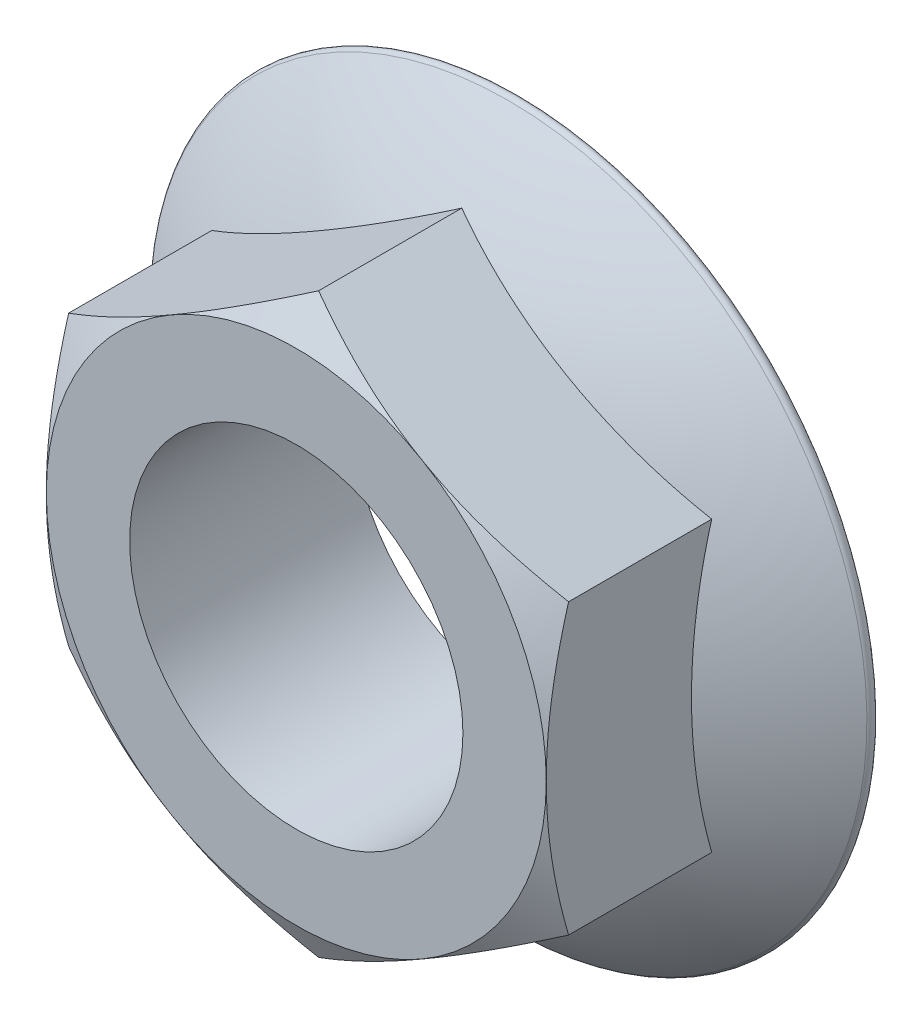
ISO-10303-21;
HEADER;
FILE_DESCRIPTION(('STEP AP214'),'2;1');
FILE_NAME('part.step','',(''),(''),'','','');
FILE_SCHEMA(('AUTOMOTIVE_DESIGN { 1 0 10303 214 1 1 1 1 }'));
ENDSEC;
DATA;
#1=APPLICATION_CONTEXT('core data for automotive mechanical design processes');
#2=APPLICATION_PROTOCOL_DEFINITION('international standard','automotive_design',2000,#1);
#3=PRODUCT_CONTEXT('',#1,'mechanical');
#4=PRODUCT('Part','Part','',(#3));
#5=PRODUCT_RELATED_PRODUCT_CATEGORY('part','',(#4));
#6=PRODUCT_DEFINITION_FORMATION('','',#4);
#7=PRODUCT_DEFINITION_CONTEXT('part definition',#1,'design');
#8=PRODUCT_DEFINITION('design','',#6,#7);
#9=PRODUCT_DEFINITION_SHAPE('','',#8);
#10=(LENGTH_UNIT() NAMED_UNIT(*) SI_UNIT(.MILLI.,.METRE.));
#11=(NAMED_UNIT(*) PLANE_ANGLE_UNIT() SI_UNIT($,.RADIAN.));
#12=(NAMED_UNIT(*) SI_UNIT($,.STERADIAN.) SOLID_ANGLE_UNIT());
#13=UNCERTAINTY_MEASURE_WITH_UNIT(LENGTH_MEASURE(1.E-05),#10,'distance_accuracy_value','');
#14=(GEOMETRIC_REPRESENTATION_CONTEXT(3) GLOBAL_UNCERTAINTY_ASSIGNED_CONTEXT((#13)) GLOBAL_UNIT_ASSIGNED_CONTEXT((#10,
#11,#12)) REPRESENTATION_CONTEXT('',''));
#15=CARTESIAN_POINT('',(0.,0.,0.));
#16=DIRECTION('',(0.,0.,1.));
#17=DIRECTION('',(1.,0.,0.));
#18=AXIS2_PLACEMENT_3D('',#15,#16,#17);
#19=CARTESIAN_POINT('',(22.5,12.9903810567666,20.));
#20=DIRECTION('',(-0.5,-0.866025403784439,0.));
#21=DIRECTION('',(0.866025403784439,-0.5,0.));
#22=AXIS2_PLACEMENT_3D('',#19,#20,#21);
#23=PLANE('',#22);
#24=CARTESIAN_POINT('',(22.5002,12.9902655867127,17.9903143896555));
#25=CARTESIAN_POINT('',(22.0056596846796,13.2757885708881,18.1551492707593));
#26=CARTESIAN_POINT('',(21.5091903987605,13.5624252467579,18.3125041584607));
#27=CARTESIAN_POINT('',(20.5122707379121,14.1379970813091,18.6101747825265));
#28=CARTESIAN_POINT('',(20.0118191109477,14.4269329628534,18.7504849147612));
#29=CARTESIAN_POINT('',(19.0059568955598,15.0076677836753,19.0121827394149));
#30=CARTESIAN_POINT('',(18.5005374245995,15.2994718512879,19.1335252438812));
#31=CARTESIAN_POINT('',(17.4862080086853,15.8850952126129,19.3546738156916));
#32=CARTESIAN_POINT('',(16.9772984166632,16.17891430256,19.4544820284597));
#33=CARTESIAN_POINT('',(15.968996914576,16.7610574462144,19.6283253044473));
#34=CARTESIAN_POINT('',(15.4696797954967,17.0493383193258,19.7029352669185));
#35=CARTESIAN_POINT('',(14.4687576454327,17.6272209921031,19.8280391846674));
#36=CARTESIAN_POINT('',(13.9671525705959,17.916822817087,19.8785326757383));
#37=CARTESIAN_POINT('',(12.9630998176583,18.4965129442762,19.954128715289));
#38=CARTESIAN_POINT('',(12.4606538548355,18.7866002561651,19.9792614354897));
#39=CARTESIAN_POINT('',(11.4552982591454,19.3670425799681,20.0035954599864));
#40=CARTESIAN_POINT('',(10.9523886410861,19.6573975833327,20.0027975655861));
#41=CARTESIAN_POINT('',(10.0121905167879,20.2002212234878,19.9770814657185));
#42=CARTESIAN_POINT('',(9.57483504956042,20.4527285202232,19.9552991118006));
#43=CARTESIAN_POINT('',(8.70116824358618,20.9571402858345,19.892536574804));
#44=CARTESIAN_POINT('',(8.26485688997456,21.2090447632926,19.8515566666916));
#45=CARTESIAN_POINT('',(7.39343951507735,21.712157819266,19.7511092481865));
#46=CARTESIAN_POINT('',(6.95833494415015,21.9633655604165,19.6916250199366));
#47=CARTESIAN_POINT('',(6.09020916212554,22.4645782143589,19.5552217340813));
#48=CARTESIAN_POINT('',(5.65718794220898,22.7145831322425,19.4783027503465));
#49=CARTESIAN_POINT('',(4.34262771135152,23.473544835394,19.2194196562896));
#50=CARTESIAN_POINT('',(3.46482360522342,23.9803452723628,19.011627893702));
#51=CARTESIAN_POINT('',(2.15781149074759,24.7349490684896,18.6578721503226));
#52=CARTESIAN_POINT('',(1.72413098376759,24.9853346259368,18.5330695175296));
#53=CARTESIAN_POINT('',(0.859769681101061,25.4843738567084,18.2708295210671));
#54=CARTESIAN_POINT('',(0.429088076540876,25.7330279970362,18.1333957185273));
#55=CARTESIAN_POINT('',(-0.000200000000005777,25.980877583587,17.9903143896555));
#56=B_SPLINE_CURVE_WITH_KNOTS('',3,(#24,#25,#26,#27,#28,#29,#30,#31,#32,#33,#34,#35,#36,#37,#38,
#39,#40,#41,#42,#43,#44,#45,#46,#47,#48,#49,#50,#51,#52,#53,#54,#55),.UNSPECIFIED.,.F.,.F.,(4,2,
2,2,2,2,2,2,2,2,2,2,2,2,2,4),(0.,1.78312722203929,3.56683913913434,5.35473780165091,
7.14245825659312,8.88609109738607,10.6297574992032,12.3713470058018,14.1128826941264,
15.6289689473497,17.1450334863602,18.6624717220614,20.1799035285482,23.281607613878,
24.8297579454588,26.3774731352151),.UNSPECIFIED.);
#57=CARTESIAN_POINT('',(22.5,12.9903810567666,17.9903810567666));
#58=VERTEX_POINT('',#57);
#59=CARTESIAN_POINT('',(11.25,19.4855715851499,20.));
#60=VERTEX_POINT('',#59);
#61=EDGE_CURVE('E113',#58,#60,#56,.T.);
#62=ORIENTED_EDGE('',*,*,#61,.F.);
#63=DIRECTION('',(0.,0.,-1.));
#64=VECTOR('',#63,1.);
#65=CARTESIAN_POINT('',(22.5,12.9903810567666,20.));
#66=LINE('',#65,#64);
#67=CARTESIAN_POINT('',(22.5,12.9903810567666,5.10562126709525));
#68=VERTEX_POINT('',#67);
#69=EDGE_CURVE('E251',#58,#68,#66,.T.);
#70=ORIENTED_EDGE('',*,*,#69,.T.);
#71=CARTESIAN_POINT('',(11.25,19.4855715851499,-40.4001136363637));
#72=DIRECTION('',(-0.5,-0.866025403784439,0.));
#73=DIRECTION('',(0.866025403784439,-0.5,0.));
#74=AXIS2_PLACEMENT_3D('',#71,#72,#73);
#75=CIRCLE('',#74,47.3235872383305);
#76=CARTESIAN_POINT('',(0.,25.9807621135332,5.10562126709525));
#77=VERTEX_POINT('',#76);
#78=EDGE_CURVE('E252',#77,#68,#75,.F.);
#79=ORIENTED_EDGE('',*,*,#78,.F.);
#80=DIRECTION('',(0.,0.,-1.));
#81=VECTOR('',#80,1.);
#82=CARTESIAN_POINT('',(0.,25.9807621135332,20.));
#83=LINE('',#82,#81);
#84=CARTESIAN_POINT('',(0.,25.9807621135332,17.9903810567666));
#85=VERTEX_POINT('',#84);
#86=EDGE_CURVE('E61',#85,#77,#83,.T.);
#87=ORIENTED_EDGE('',*,*,#86,.F.);
#88=EDGE_CURVE('E123',#60,#85,#56,.T.);
#89=ORIENTED_EDGE('',*,*,#88,.F.);
#90=EDGE_LOOP('',(#62,#70,#79,#87,#89));
#91=FACE_BOUND('',#90,.T.);
#92=ADVANCED_FACE('F38',(#91),#23,.F.);
#93=CARTESIAN_POINT('',(0.,25.9807621135332,20.));
#94=DIRECTION('',(0.5,-0.866025403784439,0.));
#95=DIRECTION('',(0.866025403784439,0.5,0.));
#96=AXIS2_PLACEMENT_3D('',#93,#94,#95);
#97=PLANE('',#96);
#98=CARTESIAN_POINT('',(0.000199999999995314,25.980877583587,17.9903143896555));
#99=CARTESIAN_POINT('',(-0.494340315320362,25.6953545994117,18.1551492707593));
#100=CARTESIAN_POINT('',(-0.990809601239483,25.4087179235419,18.3125041584607));
#101=CARTESIAN_POINT('',(-1.98772926208787,24.8331460889906,18.6101747825265));
#102=CARTESIAN_POINT('',(-2.48818088905229,24.5442102074463,18.7504849147612));
#103=CARTESIAN_POINT('',(-3.49404310444018,23.9634753866245,19.0121827394148));
#104=CARTESIAN_POINT('',(-3.99946257540048,23.6716713190119,19.1335252438812));
#105=CARTESIAN_POINT('',(-5.01379199131474,23.0860479576868,19.3546738156916));
#106=CARTESIAN_POINT('',(-5.52270158333677,22.7922288677397,19.4544820284597));
#107=CARTESIAN_POINT('',(-6.53100308542397,22.2100857240854,19.6283253044473));
#108=CARTESIAN_POINT('',(-7.0303202045033,21.9218048509739,19.7029352669185));
#109=CARTESIAN_POINT('',(-8.03124235456725,21.3439221781966,19.8280391846674));
#110=CARTESIAN_POINT('',(-8.53284742940407,21.0543203532127,19.8785326757383));
#111=CARTESIAN_POINT('',(-9.53690018234172,20.4746302260236,19.954128715289));
#112=CARTESIAN_POINT('',(-10.0393461451645,20.1845429141346,19.9792614354897));
#113=CARTESIAN_POINT('',(-11.0447017408546,19.6041005903316,20.0035954599864));
#114=CARTESIAN_POINT('',(-11.5476113589139,19.313745586967,20.0027975655861));
#115=CARTESIAN_POINT('',(-12.4878094832121,18.7709219468119,19.9770814657185));
#116=CARTESIAN_POINT('',(-12.9251649504396,18.5184146500766,19.9552991118006));
#117=CARTESIAN_POINT('',(-13.7988317564138,18.0140028844653,19.892536574804));
#118=CARTESIAN_POINT('',(-14.2351431100254,17.7620984070071,19.8515566666916));
#119=CARTESIAN_POINT('',(-15.1065604849226,17.2589853510337,19.7511092481865));
#120=CARTESIAN_POINT('',(-15.5416650558498,17.0077776098833,19.6916250199366));
#121=CARTESIAN_POINT('',(-16.4097908378745,16.5065649559409,19.5552217340813));
#122=CARTESIAN_POINT('',(-16.842812057791,16.2565600380572,19.4783027503465));
#123=CARTESIAN_POINT('',(-18.1573722886485,15.4975983349057,19.2194196562896));
#124=CARTESIAN_POINT('',(-19.0351763947766,14.9907978979369,19.011627893702));
#125=CARTESIAN_POINT('',(-20.3421885092524,14.2361941018102,18.6578721503226));
#126=CARTESIAN_POINT('',(-20.7758690162324,13.985808544363,18.5330695175296));
#127=CARTESIAN_POINT('',(-21.6402303188989,13.4867693135914,18.2708295210671));
#128=CARTESIAN_POINT('',(-22.0709119234591,13.2381151732635,18.1333957185273));
#129=CARTESIAN_POINT('',(-22.5002,12.9902655867127,17.9903143896555));
#130=B_SPLINE_CURVE_WITH_KNOTS('',3,(#98,#99,#100,#101,#102,#103,#104,#105,#106,#107,#108,#109,
#110,#111,#112,#113,#114,#115,#116,#117,#118,#119,#120,#121,#122,#123,#124,#125,#126,#127,#128,
#129),.UNSPECIFIED.,.F.,.F.,(4,2,2,2,2,2,2,2,2,2,2,2,2,2,2,4),(0.,1.78312722203929,
3.56683913913434,5.35473780165091,7.14245825659312,8.88609109738607,10.6297574992032,
12.3713470058018,14.1128826941264,15.6289689473497,17.1450334863602,18.6624717220614,
20.1799035285482,23.2816076138779,24.8297579454588,26.377473135215),.UNSPECIFIED.);
#131=CARTESIAN_POINT('',(-11.25,19.4855715851499,20.));
#132=VERTEX_POINT('',#131);
#133=EDGE_CURVE('E127',#85,#132,#130,.T.);
#134=ORIENTED_EDGE('',*,*,#133,.F.);
#135=ORIENTED_EDGE('',*,*,#86,.T.);
#136=CARTESIAN_POINT('',(-11.25,19.4855715851499,-40.4001136363637));
#137=DIRECTION('',(0.5,-0.866025403784439,0.));
#138=DIRECTION('',(0.866025403784439,0.5,0.));
#139=AXIS2_PLACEMENT_3D('',#136,#137,#138);
#140=CIRCLE('',#139,47.3235872383305);
#141=CARTESIAN_POINT('',(-22.5,12.9903810567666,5.10562126709525));
#142=VERTEX_POINT('',#141);
#143=EDGE_CURVE('E254',#142,#77,#140,.F.);
#144=ORIENTED_EDGE('',*,*,#143,.F.);
#145=DIRECTION('',(0.,0.,-1.));
#146=VECTOR('',#145,1.);
#147=CARTESIAN_POINT('',(-22.5,12.9903810567666,20.));
#148=LINE('',#147,#146);
#149=CARTESIAN_POINT('',(-22.5,12.9903810567666,17.9903810567666));
#150=VERTEX_POINT('',#149);
#151=EDGE_CURVE('E202',#150,#142,#148,.T.);
#152=ORIENTED_EDGE('',*,*,#151,.F.);
#153=EDGE_CURVE('E134',#132,#150,#130,.T.);
#154=ORIENTED_EDGE('',*,*,#153,.F.);
#155=EDGE_LOOP('',(#134,#135,#144,#152,#154));
#156=FACE_BOUND('',#155,.T.);
#157=ADVANCED_FACE('F193',(#156),#97,.F.);
#158=CARTESIAN_POINT('',(-22.5,12.9903810567666,20.));
#159=DIRECTION('',(1.,0.,0.));
#160=DIRECTION('',(0.,0.,-1.));
#161=AXIS2_PLACEMENT_3D('',#158,#159,#160);
#162=PLANE('',#161);
#163=CARTESIAN_POINT('',(-22.5,42.937910116955,5.00279973211657));
#164=CARTESIAN_POINT('',(-22.5,42.4349867908762,5.25998830996277));
#165=CARTESIAN_POINT('',(-22.5,41.9316712448641,5.51640961946833));
#166=CARTESIAN_POINT('',(-22.5,40.9241808993457,6.02756274502809));
#167=CARTESIAN_POINT('',(-22.5,40.4200060968718,6.28229455523246));
#168=CARTESIAN_POINT('',(-22.5,38.906067399752,7.04372989587428));
#169=CARTESIAN_POINT('',(-22.5,37.8949075563432,7.54766394292193));
#170=CARTESIAN_POINT('',(-22.5,35.8664336922577,8.54744404798991));
#171=CARTESIAN_POINT('',(-22.5,34.849112085713,9.04327473279685));
#172=CARTESIAN_POINT('',(-22.5,32.8091562949487,10.0239453406089));
#173=CARTESIAN_POINT('',(-22.5,31.7865220333206,10.5087851029147));
#174=CARTESIAN_POINT('',(-22.5,29.6826836887022,11.489168716423));
#175=CARTESIAN_POINT('',(-22.5,28.6011475492797,11.9840015357758));
#176=CARTESIAN_POINT('',(-22.5,26.4295684611349,12.9545883452375));
#177=CARTESIAN_POINT('',(-22.5,25.3395259663007,13.4303433451106));
#178=CARTESIAN_POINT('',(-22.5,23.6970388665296,14.1254074700941));
#179=CARTESIAN_POINT('',(-22.5,23.1484886270678,14.3539282550564));
#180=CARTESIAN_POINT('',(-22.5,22.0485270558716,14.8039685587357));
#181=CARTESIAN_POINT('',(-22.5,21.4971157654287,15.0254881781701));
#182=CARTESIAN_POINT('',(-22.5,20.3909977243873,15.4606074265542));
#183=CARTESIAN_POINT('',(-22.5,19.8362901159974,15.6742048789127));
#184=CARTESIAN_POINT('',(-22.5,18.7234476974617,16.0922649956442));
#185=CARTESIAN_POINT('',(-22.5,18.1653129401696,16.2967278004915));
#186=CARTESIAN_POINT('',(-22.5,16.9449865841485,16.7309016542748));
#187=CARTESIAN_POINT('',(-22.5,16.2820662225517,16.9585738291773));
#188=CARTESIAN_POINT('',(-22.5,14.9505731173334,17.3968937659042));
#189=CARTESIAN_POINT('',(-22.5,14.2820001805723,17.6075409433931));
#190=CARTESIAN_POINT('',(-22.5,12.9391673365046,18.0088123953236));
#191=CARTESIAN_POINT('',(-22.5,12.2649101120209,18.1994456005083));
#192=CARTESIAN_POINT('',(-22.5,10.9102777489049,18.557528643239));
#193=CARTESIAN_POINT('',(-22.5,10.2299030383091,18.7249800895596));
#194=CARTESIAN_POINT('',(-22.5,8.87571641326102,19.0303528579027));
#195=CARTESIAN_POINT('',(-22.5,8.20201537871787,19.1687624656118));
#196=CARTESIAN_POINT('',(-22.5,6.84925952001052,19.4164959045111));
#197=CARTESIAN_POINT('',(-22.5,6.17020484117956,19.5258205224797));
#198=CARTESIAN_POINT('',(-22.5,4.80795712220681,19.7122164762278));
#199=CARTESIAN_POINT('',(-22.5,4.12476611922573,19.7893025566878));
#200=CARTESIAN_POINT('',(-22.5,2.75533096919536,19.9087926707029));
#201=CARTESIAN_POINT('',(-22.5,2.06908684258476,19.9511969360801));
#202=CARTESIAN_POINT('',(-22.5,0.687324246378004,20.0001091636126));
#203=CARTESIAN_POINT('',(-22.5,-0.00820938704599759,20.0061945929854));
#204=CARTESIAN_POINT('',(-22.5,-1.39859832033207,19.9811125243047));
#205=CARTESIAN_POINT('',(-22.5,-2.09345361787947,19.9499448995746));
#206=CARTESIAN_POINT('',(-22.5,-3.48080015469796,19.8514850050863));
#207=CARTESIAN_POINT('',(-22.5,-4.17329054677869,19.7841809279115));
#208=CARTESIAN_POINT('',(-22.5,-5.55411755952298,19.6157455550603));
#209=CARTESIAN_POINT('',(-22.5,-6.24245408545503,19.5146134908613));
#210=CARTESIAN_POINT('',(-22.5,-7.62722706977454,19.2793387973371));
#211=CARTESIAN_POINT('',(-22.5,-8.32355984305464,19.1445910821305));
#212=CARTESIAN_POINT('',(-22.5,-9.7101067550967,18.846809177478));
#213=CARTESIAN_POINT('',(-22.5,-10.4003208338406,18.6837747108902));
#214=CARTESIAN_POINT('',(-22.5,-11.7745189775227,18.3330815856482));
#215=CARTESIAN_POINT('',(-22.5,-12.4585022055107,18.1454196696198));
#216=CARTESIAN_POINT('',(-22.5,-13.8202809477323,17.7489421717333));
#217=CARTESIAN_POINT('',(-22.5,-14.4980764221405,17.5401264538304));
#218=CARTESIAN_POINT('',(-22.5,-15.7921426442065,17.122402240074));
#219=CARTESIAN_POINT('',(-22.5,-16.408876911634,16.9149219806036));
#220=CARTESIAN_POINT('',(-22.5,-17.6377869149723,16.4868319747096));
#221=CARTESIAN_POINT('',(-22.5,-18.2499624656504,16.2662216980187));
#222=CARTESIAN_POINT('',(-22.5,-19.4702017344588,15.8136516015775));
#223=CARTESIAN_POINT('',(-22.5,-20.0782647898368,15.5816899998701));
#224=CARTESIAN_POINT('',(-22.5,-21.2905575041822,15.1079993142826));
#225=CARTESIAN_POINT('',(-22.5,-21.8947872099299,14.8662703498649));
#226=CARTESIAN_POINT('',(-22.5,-23.1003484017779,14.3741314470397));
#227=CARTESIAN_POINT('',(-22.5,-23.7016766801851,14.1237136653835));
#228=CARTESIAN_POINT('',(-22.5,-24.9012239962781,13.6155267116629));
#229=CARTESIAN_POINT('',(-22.5,-25.4994429898334,13.3577574355927));
#230=CARTESIAN_POINT('',(-22.5,-26.6930217519426,12.8358485601786));
#231=CARTESIAN_POINT('',(-22.5,-27.2883817976791,12.5717095939821));
#232=CARTESIAN_POINT('',(-22.5,-28.4765906338492,12.0378380893407));
#233=CARTESIAN_POINT('',(-22.5,-29.0694394044817,11.7681055068895));
#234=CARTESIAN_POINT('',(-22.5,-30.7817709336552,10.9804762057214));
#235=CARTESIAN_POINT('',(-22.5,-31.8983456673485,10.4562536555283));
#236=CARTESIAN_POINT('',(-22.5,-34.124920581488,9.39399908091055));
#237=CARTESIAN_POINT('',(-22.5,-35.2349205776655,8.85596667167259));
#238=CARTESIAN_POINT('',(-22.5,-37.4463300983147,7.77041638266378));
#239=CARTESIAN_POINT('',(-22.5,-38.5477551094307,7.22293001683052));
#240=CARTESIAN_POINT('',(-22.5,-40.1964930693805,6.39505102381711));
#241=CARTESIAN_POINT('',(-22.5,-40.745485226106,6.11799365715499));
#242=CARTESIAN_POINT('',(-22.5,-41.8424430578517,5.56186024348551));
#243=CARTESIAN_POINT('',(-22.5,-42.3904087376387,5.28278420588176));
#244=CARTESIAN_POINT('',(-22.5,-42.937910116955,5.00279973211657));
#245=B_SPLINE_CURVE_WITH_KNOTS('',3,(#163,#164,#165,#166,#167,#168,#169,#170,#171,#172,#173,
#174,#175,#176,#177,#178,#179,#180,#181,#182,#183,#184,#185,#186,#187,#188,#189,#190,#191,#192,
#193,#194,#195,#196,#197,#198,#199,#200,#201,#202,#203,#204,#205,#206,#207,#208,#209,#210,#211,
#212,#213,#214,#215,#216,#217,#218,#219,#220,#221,#222,#223,#224,#225,#226,#227,#228,#229,#230,
#231,#232,#233,#234,#235,#236,#237,#238,#239,#240,#241,#242,#243,#244),.UNSPECIFIED.,.F.,.F.,(4,
2,2,2,2,2,2,2,2,2,2,2,2,2,2,2,2,2,2,2,2,2,2,2,2,2,2,2,2,2,2,2,2,2,2,2,2,2,2,2,4),(0.,
1.69460800721614,3.3892218788855,6.77851144025748,10.1736205822667,13.5687793325238,
17.1367290228506,20.7044896163155,22.4871908668035,24.2698664600163,26.0530282634379,
27.83616263562,29.9387425585486,32.0413946160485,34.1431043928186,36.244668241324,
38.307417211311,40.3701103761814,42.431859109237,44.4935940609253,46.579269162215,
48.6649513557284,50.7513154512245,52.8377269490868,54.9648116511539,57.0919171946992,
59.2193043660852,61.3467052200283,63.2986367527605,65.250647169518,67.2029650065895,
69.1552589725683,71.1093635950016,73.0634958770022,75.0174347123852,76.9713889257113,
80.6717851506886,84.3722845998144,88.0622051563254,89.9070267613382,91.7518397781164),.UNSPECIFIED.);
#246=CARTESIAN_POINT('',(-22.5,0.,20.));
#247=VERTEX_POINT('',#246);
#248=EDGE_CURVE('E187',#150,#247,#245,.T.);
#249=ORIENTED_EDGE('',*,*,#248,.F.);
#250=ORIENTED_EDGE('',*,*,#151,.T.);
#251=CARTESIAN_POINT('',(-22.5,0.,-40.4001136363637));
#252=DIRECTION('',(1.,0.,0.));
#253=DIRECTION('',(0.,0.,-1.));
#254=AXIS2_PLACEMENT_3D('',#251,#252,#253);
#255=CIRCLE('',#254,47.3235872383305);
#256=CARTESIAN_POINT('',(-22.5,-12.9903810567666,5.10562126709524));
#257=VERTEX_POINT('',#256);
#258=EDGE_CURVE('E220',#257,#142,#255,.F.);
#259=ORIENTED_EDGE('',*,*,#258,.F.);
#260=DIRECTION('',(0.,0.,-1.));
#261=VECTOR('',#260,1.);
#262=CARTESIAN_POINT('',(-22.5,-12.9903810567666,20.));
#263=LINE('',#262,#261);
#264=CARTESIAN_POINT('',(-22.5,-12.9903810567666,17.9903810567666));
#265=VERTEX_POINT('',#264);
#266=EDGE_CURVE('E218',#265,#257,#263,.T.);
#267=ORIENTED_EDGE('',*,*,#266,.F.);
#268=EDGE_CURVE('E181',#247,#265,#245,.T.);
#269=ORIENTED_EDGE('',*,*,#268,.F.);
#270=EDGE_LOOP('',(#249,#250,#259,#267,#269));
#271=FACE_BOUND('',#270,.T.);
#272=ADVANCED_FACE('F189',(#271),#162,.F.);
#273=CARTESIAN_POINT('',(-22.5,-12.9903810567666,20.));
#274=DIRECTION('',(0.5,0.866025403784439,0.));
#275=DIRECTION('',(-0.866025403784439,0.5,0.));
#276=AXIS2_PLACEMENT_3D('',#273,#274,#275);
#277=PLANE('',#276);
#278=CARTESIAN_POINT('',(-22.5002,-12.9902655867127,17.9903143896555));
#279=CARTESIAN_POINT('',(-22.0056596846796,-13.2757885708881,18.1551492707593));
#280=CARTESIAN_POINT('',(-21.5091903987605,-13.5624252467579,18.3125041584607));
#281=CARTESIAN_POINT('',(-20.5122707379121,-14.1379970813091,18.6101747825265));
#282=CARTESIAN_POINT('',(-20.0118191109477,-14.4269329628534,18.7504849147612));
#283=CARTESIAN_POINT('',(-19.0059568955598,-15.0076677836753,19.0121827394148));
#284=CARTESIAN_POINT('',(-18.5005374245995,-15.2994718512879,19.1335252438812));
#285=CARTESIAN_POINT('',(-17.4862080086853,-15.8850952126129,19.3546738156916));
#286=CARTESIAN_POINT('',(-16.9772984166632,-16.17891430256,19.4544820284597));
#287=CARTESIAN_POINT('',(-15.968996914576,-16.7610574462144,19.6283253044473));
#288=CARTESIAN_POINT('',(-15.4696797954967,-17.0493383193258,19.7029352669185));
#289=CARTESIAN_POINT('',(-14.4687576454327,-17.6272209921031,19.8280391846674));
#290=CARTESIAN_POINT('',(-13.9671525705959,-17.916822817087,19.8785326757383));
#291=CARTESIAN_POINT('',(-12.9630998176583,-18.4965129442762,19.954128715289));
#292=CARTESIAN_POINT('',(-12.4606538548355,-18.7866002561651,19.9792614354897));
#293=CARTESIAN_POINT('',(-11.4552982591454,-19.3670425799681,20.0035954599864));
#294=CARTESIAN_POINT('',(-10.9523886410861,-19.6573975833327,20.0027975655861));
#295=CARTESIAN_POINT('',(-10.0121905167879,-20.2002212234878,19.9770814657185));
#296=CARTESIAN_POINT('',(-9.57483504956041,-20.4527285202232,19.9552991118006));
#297=CARTESIAN_POINT('',(-8.70116824358617,-20.9571402858345,19.892536574804));
#298=CARTESIAN_POINT('',(-8.26485688997455,-21.2090447632926,19.8515566666916));
#299=CARTESIAN_POINT('',(-7.39343951507735,-21.712157819266,19.7511092481865));
#300=CARTESIAN_POINT('',(-6.95833494415014,-21.9633655604165,19.6916250199366));
#301=CARTESIAN_POINT('',(-6.09020916212553,-22.4645782143589,19.5552217340813));
#302=CARTESIAN_POINT('',(-5.65718794220898,-22.7145831322425,19.4783027503465));
#303=CARTESIAN_POINT('',(-4.34262771135152,-23.473544835394,19.2194196562896));
#304=CARTESIAN_POINT('',(-3.46482360522342,-23.9803452723628,19.011627893702));
#305=CARTESIAN_POINT('',(-2.15781149074759,-24.7349490684896,18.6578721503226));
#306=CARTESIAN_POINT('',(-1.72413098376759,-24.9853346259368,18.5330695175296));
#307=CARTESIAN_POINT('',(-0.859769681101061,-25.4843738567084,18.2708295210671));
#308=CARTESIAN_POINT('',(-0.429088076540876,-25.7330279970362,18.1333957185273));
#309=CARTESIAN_POINT('',(0.000200000000003346,-25.980877583587,17.9903143896555));
#310=B_SPLINE_CURVE_WITH_KNOTS('',3,(#278,#279,#280,#281,#282,#283,#284,#285,#286,#287,#288,
#289,#290,#291,#292,#293,#294,#295,#296,#297,#298,#299,#300,#301,#302,#303,#304,#305,#306,#307,
#308,#309),.UNSPECIFIED.,.F.,.F.,(4,2,2,2,2,2,2,2,2,2,2,2,2,2,2,4),(0.,1.78312722203929,
3.56683913913434,5.35473780165091,7.14245825659312,8.88609109738608,10.6297574992032,
12.3713470058018,14.1128826941264,15.6289689473497,17.1450334863602,18.6624717220614,
20.1799035285482,23.2816076138779,24.8297579454588,26.377473135215),.UNSPECIFIED.);
#311=CARTESIAN_POINT('',(-11.25,-19.4855715851499,20.));
#312=VERTEX_POINT('',#311);
#313=EDGE_CURVE('E188',#265,#312,#310,.T.);
#314=ORIENTED_EDGE('',*,*,#313,.F.);
#315=ORIENTED_EDGE('',*,*,#266,.T.);
#316=CARTESIAN_POINT('',(-11.25,-19.4855715851499,-40.4001136363637));
#317=DIRECTION('',(0.5,0.866025403784439,0.));
#318=DIRECTION('',(-0.866025403784439,0.5,0.));
#319=AXIS2_PLACEMENT_3D('',#316,#317,#318);
#320=CIRCLE('',#319,47.3235872383305);
#321=CARTESIAN_POINT('',(0.,-25.9807621135332,5.10562126709525));
#322=VERTEX_POINT('',#321);
#323=EDGE_CURVE('E260',#322,#257,#320,.F.);
#324=ORIENTED_EDGE('',*,*,#323,.F.);
#325=DIRECTION('',(0.,0.,-1.));
#326=VECTOR('',#325,1.);
#327=CARTESIAN_POINT('',(0.,-25.9807621135332,20.));
#328=LINE('',#327,#326);
#329=CARTESIAN_POINT('',(0.,-25.9807621135332,17.9903810567666));
#330=VERTEX_POINT('',#329);
#331=EDGE_CURVE('E224',#330,#322,#328,.T.);
#332=ORIENTED_EDGE('',*,*,#331,.F.);
#333=EDGE_CURVE('E175',#312,#330,#310,.T.);
#334=ORIENTED_EDGE('',*,*,#333,.F.);
#335=EDGE_LOOP('',(#314,#315,#324,#332,#334));
#336=FACE_BOUND('',#335,.T.);
#337=ADVANCED_FACE('F192',(#336),#277,.F.);
#338=CARTESIAN_POINT('',(0.,-25.9807621135332,20.));
#339=DIRECTION('',(-0.5,0.866025403784439,0.));
#340=DIRECTION('',(-0.866025403784439,-0.5,0.));
#341=AXIS2_PLACEMENT_3D('',#338,#339,#340);
#342=PLANE('',#341);
#343=CARTESIAN_POINT('',(-0.000199999999997071,-25.980877583587,17.9903143896555));
#344=CARTESIAN_POINT('',(0.494340315320359,-25.6953545994117,18.1551492707593));
#345=CARTESIAN_POINT('',(0.99080960123948,-25.4087179235419,18.3125041584607));
#346=CARTESIAN_POINT('',(1.98772926208787,-24.8331460889906,18.6101747825265));
#347=CARTESIAN_POINT('',(2.48818088905229,-24.5442102074463,18.7504849147612));
#348=CARTESIAN_POINT('',(3.49404310444018,-23.9634753866245,19.0121827394148));
#349=CARTESIAN_POINT('',(3.99946257540048,-23.6716713190119,19.1335252438812));
#350=CARTESIAN_POINT('',(5.01379199131474,-23.0860479576868,19.3546738156916));
#351=CARTESIAN_POINT('',(5.52270158333677,-22.7922288677397,19.4544820284597));
#352=CARTESIAN_POINT('',(6.53100308542397,-22.2100857240854,19.6283253044473));
#353=CARTESIAN_POINT('',(7.0303202045033,-21.9218048509739,19.7029352669185));
#354=CARTESIAN_POINT('',(8.03124235456725,-21.3439221781966,19.8280391846674));
#355=CARTESIAN_POINT('',(8.53284742940407,-21.0543203532127,19.8785326757383));
#356=CARTESIAN_POINT('',(9.53690018234172,-20.4746302260236,19.954128715289));
#357=CARTESIAN_POINT('',(10.0393461451645,-20.1845429141346,19.9792614354897));
#358=CARTESIAN_POINT('',(11.0447017408546,-19.6041005903316,20.0035954599864));
#359=CARTESIAN_POINT('',(11.5476113589139,-19.313745586967,20.0027975655861));
#360=CARTESIAN_POINT('',(12.4878094832121,-18.7709219468119,19.9770814657185));
#361=CARTESIAN_POINT('',(12.9251649504396,-18.5184146500765,19.9552991118006));
#362=CARTESIAN_POINT('',(13.7988317564138,-18.0140028844653,19.892536574804));
#363=CARTESIAN_POINT('',(14.2351431100254,-17.7620984070071,19.8515566666916));
#364=CARTESIAN_POINT('',(15.1065604849226,-17.2589853510337,19.7511092481865));
#365=CARTESIAN_POINT('',(15.5416650558498,-17.0077776098832,19.6916250199366));
#366=CARTESIAN_POINT('',(16.4097908378745,-16.5065649559409,19.5552217340813));
#367=CARTESIAN_POINT('',(16.842812057791,-16.2565600380572,19.4783027503465));
#368=CARTESIAN_POINT('',(18.1573722886485,-15.4975983349057,19.2194196562896));
#369=CARTESIAN_POINT('',(19.0351763947766,-14.9907978979369,19.011627893702));
#370=CARTESIAN_POINT('',(20.3421885092524,-14.2361941018102,18.6578721503226));
#371=CARTESIAN_POINT('',(20.7758690162324,-13.985808544363,18.5330695175296));
#372=CARTESIAN_POINT('',(21.6402303188989,-13.4867693135914,18.2708295210671));
#373=CARTESIAN_POINT('',(22.0709119234591,-13.2381151732635,18.1333957185273));
#374=CARTESIAN_POINT('',(22.5002,-12.9902655867127,17.9903143896555));
#375=B_SPLINE_CURVE_WITH_KNOTS('',3,(#343,#344,#345,#346,#347,#348,#349,#350,#351,#352,#353,
#354,#355,#356,#357,#358,#359,#360,#361,#362,#363,#364,#365,#366,#367,#368,#369,#370,#371,#372,
#373,#374),.UNSPECIFIED.,.F.,.F.,(4,2,2,2,2,2,2,2,2,2,2,2,2,2,2,4),(0.,1.78312722203929,
3.56683913913434,5.35473780165091,7.14245825659312,8.88609109738608,10.6297574992032,
12.3713470058018,14.1128826941264,15.6289689473497,17.1450334863602,18.6624717220614,
20.1799035285482,23.281607613878,24.8297579454588,26.3774731352151),.UNSPECIFIED.);
#376=CARTESIAN_POINT('',(11.25,-19.4855715851499,20.));
#377=VERTEX_POINT('',#376);
#378=EDGE_CURVE('E243',#330,#377,#375,.T.);
#379=ORIENTED_EDGE('',*,*,#378,.F.);
#380=ORIENTED_EDGE('',*,*,#331,.T.);
#381=CARTESIAN_POINT('',(11.25,-19.4855715851499,-40.4001136363637));
#382=DIRECTION('',(-0.5,0.866025403784439,0.));
#383=DIRECTION('',(-0.866025403784439,-0.5,0.));
#384=AXIS2_PLACEMENT_3D('',#381,#382,#383);
#385=CIRCLE('',#384,47.3235872383305);
#386=CARTESIAN_POINT('',(22.5,-12.9903810567666,5.10562126709525));
#387=VERTEX_POINT('',#386);
#388=EDGE_CURVE('E262',#387,#322,#385,.F.);
#389=ORIENTED_EDGE('',*,*,#388,.F.);
#390=DIRECTION('',(0.,0.,-1.));
#391=VECTOR('',#390,1.);
#392=CARTESIAN_POINT('',(22.5,-12.9903810567666,20.));
#393=LINE('',#392,#391);
#394=CARTESIAN_POINT('',(22.5,-12.9903810567666,17.9903810567666));
#395=VERTEX_POINT('',#394);
#396=EDGE_CURVE('E227',#395,#387,#393,.T.);
#397=ORIENTED_EDGE('',*,*,#396,.F.);
#398=EDGE_CURVE('E168',#377,#395,#375,.T.);
#399=ORIENTED_EDGE('',*,*,#398,.F.);
#400=EDGE_LOOP('',(#379,#380,#389,#397,#399));
#401=FACE_BOUND('',#400,.T.);
#402=ADVANCED_FACE('F242',(#401),#342,.F.);
#403=CARTESIAN_POINT('',(22.5,-12.9903810567666,20.));
#404=DIRECTION('',(-1.,0.,0.));
#405=DIRECTION('',(0.,-1.,0.));
#406=AXIS2_PLACEMENT_3D('',#403,#404,#405);
#407=PLANE('',#406);
#408=CARTESIAN_POINT('',(22.5,-42.937910116955,5.00279973211658));
#409=CARTESIAN_POINT('',(22.5,-42.4349867908762,5.25998830996278));
#410=CARTESIAN_POINT('',(22.5,-41.9316712448641,5.51640961946833));
#411=CARTESIAN_POINT('',(22.5,-40.9241808993457,6.02756274502809));
#412=CARTESIAN_POINT('',(22.5,-40.4200060968718,6.28229455523247));
#413=CARTESIAN_POINT('',(22.5,-38.906067399752,7.0437298958743));
#414=CARTESIAN_POINT('',(22.5,-37.8949075563431,7.54766394292194));
#415=CARTESIAN_POINT('',(22.5,-35.8664336922576,8.54744404798993));
#416=CARTESIAN_POINT('',(22.5,-34.849112085713,9.04327473279686));
#417=CARTESIAN_POINT('',(22.5,-32.8091562949487,10.0239453406089));
#418=CARTESIAN_POINT('',(22.5,-31.7865220333206,10.5087851029147));
#419=CARTESIAN_POINT('',(22.5,-29.6826836887022,11.489168716423));
#420=CARTESIAN_POINT('',(22.5,-28.6011475492797,11.9840015357758));
#421=CARTESIAN_POINT('',(22.5,-26.4295684611348,12.9545883452375));
#422=CARTESIAN_POINT('',(22.5,-25.3395259663007,13.4303433451106));
#423=CARTESIAN_POINT('',(22.5,-23.6970388665296,14.1254074700941));
#424=CARTESIAN_POINT('',(22.5,-23.1484886270678,14.3539282550564));
#425=CARTESIAN_POINT('',(22.5,-22.0485270558716,14.8039685587357));
#426=CARTESIAN_POINT('',(22.5,-21.4971157654287,15.0254881781701));
#427=CARTESIAN_POINT('',(22.5,-20.3909977243873,15.4606074265542));
#428=CARTESIAN_POINT('',(22.5,-19.8362901159973,15.6742048789127));
#429=CARTESIAN_POINT('',(22.5,-18.7234476974617,16.0922649956442));
#430=CARTESIAN_POINT('',(22.5,-18.1653129401696,16.2967278004915));
#431=CARTESIAN_POINT('',(22.5,-16.9449865841485,16.7309016542748));
#432=CARTESIAN_POINT('',(22.5,-16.2820662225517,16.9585738291773));
#433=CARTESIAN_POINT('',(22.5,-14.9505731173334,17.3968937659042));
#434=CARTESIAN_POINT('',(22.5,-14.2820001805723,17.6075409433931));
#435=CARTESIAN_POINT('',(22.5,-12.9391673365046,18.0088123953236));
#436=CARTESIAN_POINT('',(22.5,-12.2649101120209,18.1994456005083));
#437=CARTESIAN_POINT('',(22.5,-10.9102777489049,18.557528643239));
#438=CARTESIAN_POINT('',(22.5,-10.2299030383091,18.7249800895596));
#439=CARTESIAN_POINT('',(22.5,-8.87571641326101,19.0303528579027));
#440=CARTESIAN_POINT('',(22.5,-8.20201537871785,19.1687624656118));
#441=CARTESIAN_POINT('',(22.5,-6.8492595200105,19.4164959045111));
#442=CARTESIAN_POINT('',(22.5,-6.17020484117954,19.5258205224797));
#443=CARTESIAN_POINT('',(22.5,-4.80795712220679,19.7122164762278));
#444=CARTESIAN_POINT('',(22.5,-4.12476611922571,19.7893025566878));
#445=CARTESIAN_POINT('',(22.5,-2.75533096919535,19.9087926707029));
#446=CARTESIAN_POINT('',(22.5,-2.06908684258474,19.9511969360801));
#447=CARTESIAN_POINT('',(22.5,-0.687324246377989,20.0001091636126));
#448=CARTESIAN_POINT('',(22.5,0.00820938704601114,20.0061945929854));
#449=CARTESIAN_POINT('',(22.5,1.39859832033209,19.9811125243047));
#450=CARTESIAN_POINT('',(22.5,2.09345361787948,19.9499448995746));
#451=CARTESIAN_POINT('',(22.5,3.48080015469797,19.8514850050863));
#452=CARTESIAN_POINT('',(22.5,4.17329054677871,19.7841809279115));
#453=CARTESIAN_POINT('',(22.5,5.55411755952299,19.6157455550602));
#454=CARTESIAN_POINT('',(22.5,6.24245408545505,19.5146134908613));
#455=CARTESIAN_POINT('',(22.5,7.62722706977455,19.2793387973371));
#456=CARTESIAN_POINT('',(22.5,8.32355984305466,19.1445910821305));
#457=CARTESIAN_POINT('',(22.5,9.71010675509672,18.846809177478));
#458=CARTESIAN_POINT('',(22.5,10.4003208338406,18.6837747108902));
#459=CARTESIAN_POINT('',(22.5,11.7745189775227,18.3330815856482));
#460=CARTESIAN_POINT('',(22.5,12.4585022055107,18.1454196696198));
#461=CARTESIAN_POINT('',(22.5,13.8202809477323,17.7489421717333));
#462=CARTESIAN_POINT('',(22.5,14.4980764221406,17.5401264538304));
#463=CARTESIAN_POINT('',(22.5,15.7921426442065,17.122402240074));
#464=CARTESIAN_POINT('',(22.5,16.408876911634,16.9149219806036));
#465=CARTESIAN_POINT('',(22.5,17.6377869149723,16.4868319747096));
#466=CARTESIAN_POINT('',(22.5,18.2499624656504,16.2662216980187));
#467=CARTESIAN_POINT('',(22.5,19.4702017344588,15.8136516015775));
#468=CARTESIAN_POINT('',(22.5,20.0782647898368,15.5816899998701));
#469=CARTESIAN_POINT('',(22.5,21.2905575041822,15.1079993142826));
#470=CARTESIAN_POINT('',(22.5,21.8947872099299,14.8662703498649));
#471=CARTESIAN_POINT('',(22.5,23.1003484017779,14.3741314470397));
#472=CARTESIAN_POINT('',(22.5,23.7016766801851,14.1237136653835));
#473=CARTESIAN_POINT('',(22.5,24.9012239962781,13.6155267116629));
#474=CARTESIAN_POINT('',(22.5,25.4994429898334,13.3577574355927));
#475=CARTESIAN_POINT('',(22.5,26.6930217519426,12.8358485601786));
#476=CARTESIAN_POINT('',(22.5,27.2883817976791,12.5717095939821));
#477=CARTESIAN_POINT('',(22.5,28.4765906338492,12.0378380893407));
#478=CARTESIAN_POINT('',(22.5,29.0694394044817,11.7681055068895));
#479=CARTESIAN_POINT('',(22.5,30.7817709336552,10.9804762057214));
#480=CARTESIAN_POINT('',(22.5,31.8983456673484,10.4562536555283));
#481=CARTESIAN_POINT('',(22.5,34.124920581488,9.39399908091056));
#482=CARTESIAN_POINT('',(22.5,35.2349205776655,8.8559666716726));
#483=CARTESIAN_POINT('',(22.5,37.4463300983147,7.77041638266379));
#484=CARTESIAN_POINT('',(22.5,38.5477551094307,7.22293001683052));
#485=CARTESIAN_POINT('',(22.5,40.1964930693805,6.39505102381711));
#486=CARTESIAN_POINT('',(22.5,40.745485226106,6.11799365715499));
#487=CARTESIAN_POINT('',(22.5,41.8424430578517,5.56186024348552));
#488=CARTESIAN_POINT('',(22.5,42.3904087376386,5.28278420588177));
#489=CARTESIAN_POINT('',(22.5,42.937910116955,5.00279973211658));
#490=B_SPLINE_CURVE_WITH_KNOTS('',3,(#408,#409,#410,#411,#412,#413,#414,#415,#416,#417,#418,
#419,#420,#421,#422,#423,#424,#425,#426,#427,#428,#429,#430,#431,#432,#433,#434,#435,#436,#437,
#438,#439,#440,#441,#442,#443,#444,#445,#446,#447,#448,#449,#450,#451,#452,#453,#454,#455,#456,
#457,#458,#459,#460,#461,#462,#463,#464,#465,#466,#467,#468,#469,#470,#471,#472,#473,#474,#475,
#476,#477,#478,#479,#480,#481,#482,#483,#484,#485,#486,#487,#488,#489),.UNSPECIFIED.,.F.,.F.,(4,
2,2,2,2,2,2,2,2,2,2,2,2,2,2,2,2,2,2,2,2,2,2,2,2,2,2,2,2,2,2,2,2,2,2,2,2,2,2,2,4),(0.,
1.69460800721613,3.38922187888549,6.77851144025747,10.1736205822667,13.5687793325238,
17.1367290228506,20.7044896163155,22.4871908668035,24.2698664600163,26.0530282634379,
27.83616263562,29.9387425585486,32.0413946160485,34.1431043928186,36.2446682413239,
38.307417211311,40.3701103761814,42.431859109237,44.4935940609252,46.579269162215,
48.6649513557284,50.7513154512245,52.8377269490867,54.9648116511539,57.0919171946992,
59.2193043660852,61.3467052200283,63.2986367527605,65.250647169518,67.2029650065895,
69.1552589725683,71.1093635950016,73.0634958770022,75.0174347123851,76.9713889257113,
80.6717851506886,84.3722845998144,88.0622051563254,89.9070267613382,91.7518397781163),.UNSPECIFIED.);
#491=CARTESIAN_POINT('',(22.5,0.,20.));
#492=VERTEX_POINT('',#491);
#493=EDGE_CURVE('E248',#395,#492,#490,.T.);
#494=ORIENTED_EDGE('',*,*,#493,.F.);
#495=ORIENTED_EDGE('',*,*,#396,.T.);
#496=CARTESIAN_POINT('',(22.5,0.,-40.4001136363637));
#497=DIRECTION('',(-1.,0.,0.));
#498=DIRECTION('',(0.,-1.,0.));
#499=AXIS2_PLACEMENT_3D('',#496,#497,#498);
#500=CIRCLE('',#499,47.3235872383305);
#501=EDGE_CURVE('E231',#68,#387,#500,.F.);
#502=ORIENTED_EDGE('',*,*,#501,.F.);
#503=ORIENTED_EDGE('',*,*,#69,.F.);
#504=EDGE_CURVE('E118',#492,#58,#490,.T.);
#505=ORIENTED_EDGE('',*,*,#504,.F.);
#506=EDGE_LOOP('',(#494,#495,#502,#503,#505));
#507=FACE_BOUND('',#506,.T.);
#508=ADVANCED_FACE('F250',(#507),#407,.F.);
#509=CARTESIAN_POINT('',(0.,0.,-40.4001136363637));
#510=DIRECTION('',(0.,0.,-1.));
#511=DIRECTION('',(0.,1.,0.));
#512=AXIS2_PLACEMENT_3D('',#509,#510,#511);
#513=SPHERICAL_SURFACE('',#512,52.4001136363642);
#514=CARTESIAN_POINT('',(0.,0.,0.89402720698235));
#515=DIRECTION('',(0.,0.,-1.));
#516=DIRECTION('',(0.,1.,0.));
#517=AXIS2_PLACEMENT_3D('',#514,#515,#516);
#518=CIRCLE('',#517,32.2578027942664);
#519=CARTESIAN_POINT('',(0.,32.2578027942664,0.894027206982354));
#520=VERTEX_POINT('',#519);
#521=EDGE_CURVE('E263',#520,#520,#518,.T.);
#522=ORIENTED_EDGE('',*,*,#521,.F.);
#523=EDGE_LOOP('',(#522));
#524=FACE_BOUND('',#523,.T.);
#525=ORIENTED_EDGE('',*,*,#143,.T.);
#526=ORIENTED_EDGE('',*,*,#78,.T.);
#527=ORIENTED_EDGE('',*,*,#501,.T.);
#528=ORIENTED_EDGE('',*,*,#388,.T.);
#529=ORIENTED_EDGE('',*,*,#323,.T.);
#530=ORIENTED_EDGE('',*,*,#258,.T.);
#531=EDGE_LOOP('',(#525,#526,#527,#528,#529,#530));
#532=FACE_BOUND('',#531,.T.);
#533=ADVANCED_FACE('F273',(#524,#532),#513,.T.);
#534=CARTESIAN_POINT('',(0.,0.,0.500000000000004));
#535=DIRECTION('',(0.,0.,-1.));
#536=DIRECTION('',(0.,1.,0.));
#537=AXIS2_PLACEMENT_3D('',#534,#535,#536);
#538=TOROIDAL_SURFACE('',#537,31.95,0.500000000000507);
#539=CARTESIAN_POINT('',(0.,0.,-5.0349387019994E-13));
#540=DIRECTION('',(0.,0.,-1.));
#541=DIRECTION('',(0.,1.,0.));
#542=AXIS2_PLACEMENT_3D('',#539,#540,#541);
#543=CIRCLE('',#542,31.95);
#544=CARTESIAN_POINT('',(0.,31.95,-4.99581123676664E-13));
#545=VERTEX_POINT('',#544);
#546=EDGE_CURVE('E122',#545,#545,#543,.T.);
#547=ORIENTED_EDGE('',*,*,#546,.F.);
#548=EDGE_LOOP('',(#547));
#549=FACE_BOUND('',#548,.T.);
#550=ORIENTED_EDGE('',*,*,#521,.T.);
#551=EDGE_LOOP('',(#550));
#552=FACE_BOUND('',#551,.T.);
#553=ADVANCED_FACE('F154',(#549,#552),#538,.T.);
#554=CARTESIAN_POINT('',(0.,0.,0.));
#555=DIRECTION('',(0.,0.,1.));
#556=DIRECTION('',(1.,0.,0.));
#557=AXIS2_PLACEMENT_3D('',#554,#555,#556);
#558=PLANE('',#557);
#559=CARTESIAN_POINT('',(0.,0.,0.));
#560=DIRECTION('',(0.,0.,1.));
#561=DIRECTION('',(1.,0.,0.));
#562=AXIS2_PLACEMENT_3D('',#559,#560,#561);
#563=CIRCLE('',#562,15.);
#564=CARTESIAN_POINT('',(15.,0.,0.));
#565=VERTEX_POINT('',#564);
#566=EDGE_CURVE('E132',#565,#565,#563,.F.);
#567=ORIENTED_EDGE('',*,*,#566,.F.);
#568=EDGE_LOOP('',(#567));
#569=FACE_BOUND('',#568,.T.);
#570=ORIENTED_EDGE('',*,*,#546,.T.);
#571=EDGE_LOOP('',(#570));
#572=FACE_BOUND('',#571,.T.);
#573=ADVANCED_FACE('F270',(#569,#572),#558,.F.);
#574=CARTESIAN_POINT('',(0.,0.,20.));
#575=DIRECTION('',(0.,0.,-1.));
#576=DIRECTION('',(1.,0.,0.));
#577=AXIS2_PLACEMENT_3D('',#574,#575,#576);
#578=CONICAL_SURFACE('',#577,22.5,1.0471975511966);
#579=ORIENTED_EDGE('',*,*,#398,.T.);
#580=ORIENTED_EDGE('',*,*,#493,.T.);
#581=CARTESIAN_POINT('',(0.,0.,20.));
#582=DIRECTION('',(0.,0.,1.));
#583=DIRECTION('',(1.,0.,0.));
#584=AXIS2_PLACEMENT_3D('',#581,#582,#583);
#585=CIRCLE('',#584,22.5);
#586=EDGE_CURVE('E42',#377,#492,#585,.T.);
#587=ORIENTED_EDGE('',*,*,#586,.F.);
#588=EDGE_LOOP('',(#579,#580,#587));
#589=FACE_BOUND('',#588,.T.);
#590=ADVANCED_FACE('F152',(#589),#578,.T.);
#591=ORIENTED_EDGE('',*,*,#333,.T.);
#592=ORIENTED_EDGE('',*,*,#378,.T.);
#593=EDGE_CURVE('E215',#312,#377,#585,.T.);
#594=ORIENTED_EDGE('',*,*,#593,.F.);
#595=EDGE_LOOP('',(#591,#592,#594));
#596=FACE_BOUND('',#595,.T.);
#597=ADVANCED_FACE('F295',(#596),#578,.T.);
#598=ORIENTED_EDGE('',*,*,#268,.T.);
#599=ORIENTED_EDGE('',*,*,#313,.T.);
#600=EDGE_CURVE('E210',#247,#312,#585,.T.);
#601=ORIENTED_EDGE('',*,*,#600,.F.);
#602=EDGE_LOOP('',(#598,#599,#601));
#603=FACE_BOUND('',#602,.T.);
#604=ADVANCED_FACE('F211',(#603),#578,.T.);
#605=ORIENTED_EDGE('',*,*,#153,.T.);
#606=ORIENTED_EDGE('',*,*,#248,.T.);
#607=EDGE_CURVE('E47',#132,#247,#585,.T.);
#608=ORIENTED_EDGE('',*,*,#607,.F.);
#609=EDGE_LOOP('',(#605,#606,#608));
#610=FACE_BOUND('',#609,.T.);
#611=ADVANCED_FACE('F206',(#610),#578,.T.);
#612=ORIENTED_EDGE('',*,*,#88,.T.);
#613=ORIENTED_EDGE('',*,*,#133,.T.);
#614=EDGE_CURVE('E12',#60,#132,#585,.T.);
#615=ORIENTED_EDGE('',*,*,#614,.F.);
#616=EDGE_LOOP('',(#612,#613,#615));
#617=FACE_BOUND('',#616,.T.);
#618=ADVANCED_FACE('F126',(#617),#578,.T.);
#619=ORIENTED_EDGE('',*,*,#61,.T.);
#620=CARTESIAN_POINT('',(0.,0.,20.));
#621=DIRECTION('',(0.,0.,1.));
#622=DIRECTION('',(1.,0.,0.));
#623=AXIS2_PLACEMENT_3D('',#620,#621,#622);
#624=CIRCLE('',#623,22.5);
#625=EDGE_CURVE('E116',#492,#60,#624,.T.);
#626=ORIENTED_EDGE('',*,*,#625,.F.);
#627=ORIENTED_EDGE('',*,*,#504,.T.);
#628=EDGE_LOOP('',(#619,#626,#627));
#629=FACE_BOUND('',#628,.T.);
#630=ADVANCED_FACE('F115',(#629),#578,.T.);
#631=CARTESIAN_POINT('',(0.,0.,20.));
#632=DIRECTION('',(0.,0.,1.));
#633=DIRECTION('',(1.,0.,0.));
#634=AXIS2_PLACEMENT_3D('',#631,#632,#633);
#635=PLANE('',#634);
#636=CARTESIAN_POINT('',(0.,0.,20.));
#637=DIRECTION('',(0.,0.,1.));
#638=DIRECTION('',(1.,0.,0.));
#639=AXIS2_PLACEMENT_3D('',#636,#637,#638);
#640=CIRCLE('',#639,15.);
#641=CARTESIAN_POINT('',(15.,0.,20.));
#642=VERTEX_POINT('',#641);
#643=EDGE_CURVE('E407',#642,#642,#640,.T.);
#644=ORIENTED_EDGE('',*,*,#643,.F.);
#645=EDGE_LOOP('',(#644));
#646=FACE_BOUND('',#645,.T.);
#647=ORIENTED_EDGE('',*,*,#586,.T.);
#648=ORIENTED_EDGE('',*,*,#625,.T.);
#649=ORIENTED_EDGE('',*,*,#614,.T.);
#650=ORIENTED_EDGE('',*,*,#607,.T.);
#651=ORIENTED_EDGE('',*,*,#600,.T.);
#652=ORIENTED_EDGE('',*,*,#593,.T.);
#653=EDGE_LOOP('',(#647,#648,#649,#650,#651,#652));
#654=FACE_BOUND('',#653,.T.);
#655=ADVANCED_FACE('F131',(#646,#654),#635,.T.);
#656=CARTESIAN_POINT('',(0.,0.,-0.0010000000005006));
#657=DIRECTION('',(0.,0.,1.));
#658=DIRECTION('',(1.,0.,0.));
#659=AXIS2_PLACEMENT_3D('',#656,#657,#658);
#660=CYLINDRICAL_SURFACE('',#659,15.);
#661=ORIENTED_EDGE('',*,*,#643,.T.);
#662=EDGE_LOOP('',(#661));
#663=FACE_BOUND('',#662,.T.);
#664=ORIENTED_EDGE('',*,*,#566,.T.);
#665=EDGE_LOOP('',(#664));
#666=FACE_BOUND('',#665,.T.);
#667=ADVANCED_FACE('F153',(#663,#666),#660,.F.);
#668=CLOSED_SHELL('',(#92,#157,#272,#337,#402,#508,#533,#553,#573,#590,#597,#604,#611,#618,#630,
#655,#667));
#669=MANIFOLD_SOLID_BREP('B2',#668);
#670=ADVANCED_BREP_SHAPE_REPRESENTATION('',(#18,#669),#14);
#671=SHAPE_DEFINITION_REPRESENTATION(#9,#670);
ENDSEC;
END-ISO-10303-21;
